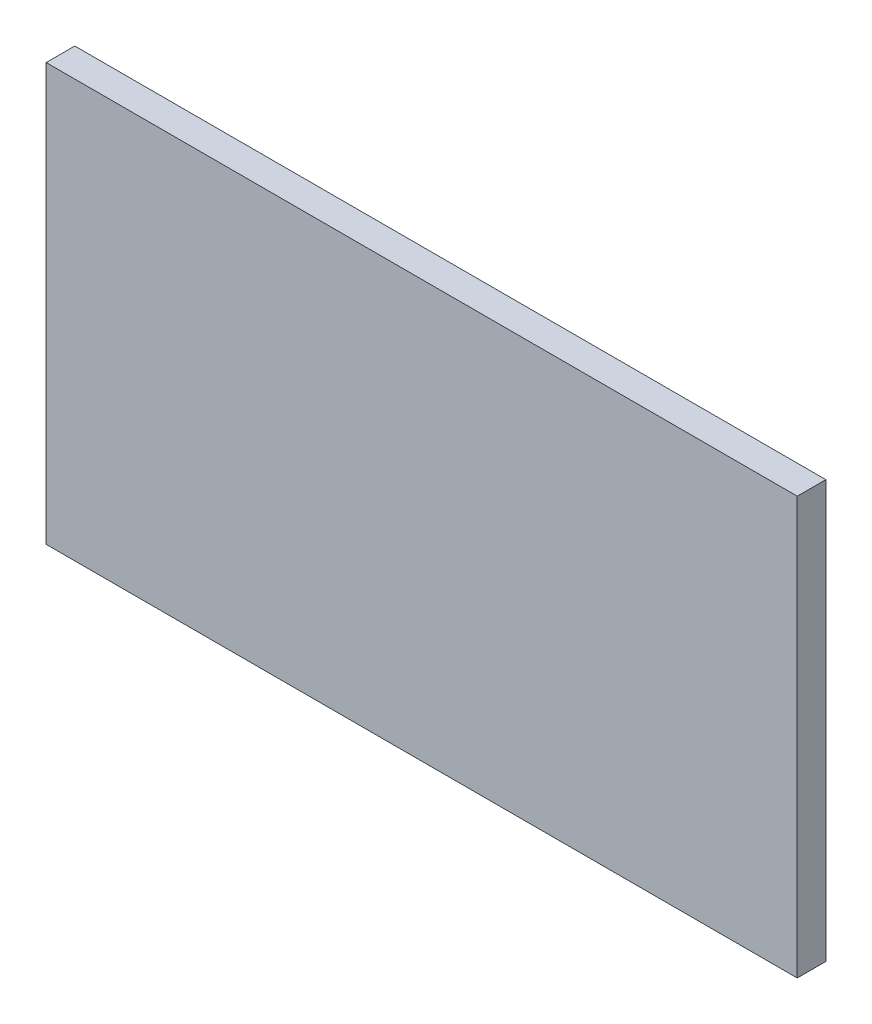
ISO-10303-21;
HEADER;
FILE_DESCRIPTION(('STEP AP214'),'2;1');
FILE_NAME('part.step','',(''),(''),'','','');
FILE_SCHEMA(('AUTOMOTIVE_DESIGN { 1 0 10303 214 1 1 1 1 }'));
ENDSEC;
DATA;
#1=APPLICATION_CONTEXT('core data for automotive mechanical design processes');
#2=APPLICATION_PROTOCOL_DEFINITION('international standard','automotive_design',2000,#1);
#3=PRODUCT_CONTEXT('',#1,'mechanical');
#4=PRODUCT('Part','Part','',(#3));
#5=PRODUCT_RELATED_PRODUCT_CATEGORY('part','',(#4));
#6=PRODUCT_DEFINITION_FORMATION('','',#4);
#7=PRODUCT_DEFINITION_CONTEXT('part definition',#1,'design');
#8=PRODUCT_DEFINITION('design','',#6,#7);
#9=PRODUCT_DEFINITION_SHAPE('','',#8);
#10=(LENGTH_UNIT() NAMED_UNIT(*) SI_UNIT(.MILLI.,.METRE.));
#11=(NAMED_UNIT(*) PLANE_ANGLE_UNIT() SI_UNIT($,.RADIAN.));
#12=(NAMED_UNIT(*) SI_UNIT($,.STERADIAN.) SOLID_ANGLE_UNIT());
#13=UNCERTAINTY_MEASURE_WITH_UNIT(LENGTH_MEASURE(1.E-05),#10,'distance_accuracy_value','');
#14=(GEOMETRIC_REPRESENTATION_CONTEXT(3) GLOBAL_UNCERTAINTY_ASSIGNED_CONTEXT((#13)) GLOBAL_UNIT_ASSIGNED_CONTEXT((#10,
#11,#12)) REPRESENTATION_CONTEXT('',''));
#15=CARTESIAN_POINT('',(0.,0.,0.));
#16=DIRECTION('',(0.,0.,1.));
#17=DIRECTION('',(1.,0.,0.));
#18=AXIS2_PLACEMENT_3D('',#15,#16,#17);
#19=CARTESIAN_POINT('',(0.70008,6.4,0.));
#20=DIRECTION('',(0.,0.,-1.));
#21=DIRECTION('',(-1.,0.,0.));
#22=AXIS2_PLACEMENT_3D('',#19,#20,#21);
#23=PLANE('',#22);
#24=DIRECTION('',(1.,0.,0.));
#25=VECTOR('',#24,1.);
#26=CARTESIAN_POINT('',(0.25008,6.65,0.));
#27=LINE('',#26,#25);
#28=CARTESIAN_POINT('',(0.25008,6.65,0.));
#29=VERTEX_POINT('',#28);
#30=CARTESIAN_POINT('',(1.15008,6.65,0.));
#31=VERTEX_POINT('',#30);
#32=EDGE_CURVE('E55',#29,#31,#27,.T.);
#33=ORIENTED_EDGE('',*,*,#32,.T.);
#34=DIRECTION('',(0.,1.,0.));
#35=VECTOR('',#34,1.);
#36=CARTESIAN_POINT('',(1.15008,6.65,0.));
#37=LINE('',#36,#35);
#38=CARTESIAN_POINT('',(1.15008,6.15,0.));
#39=VERTEX_POINT('',#38);
#40=EDGE_CURVE('E57',#31,#39,#37,.F.);
#41=ORIENTED_EDGE('',*,*,#40,.T.);
#42=DIRECTION('',(1.,0.,0.));
#43=VECTOR('',#42,1.);
#44=CARTESIAN_POINT('',(1.15008,6.15,0.));
#45=LINE('',#44,#43);
#46=CARTESIAN_POINT('',(0.25008,6.15,0.));
#47=VERTEX_POINT('',#46);
#48=EDGE_CURVE('E20',#39,#47,#45,.F.);
#49=ORIENTED_EDGE('',*,*,#48,.T.);
#50=DIRECTION('',(0.,1.,0.));
#51=VECTOR('',#50,1.);
#52=CARTESIAN_POINT('',(0.25008,6.15,0.));
#53=LINE('',#52,#51);
#54=EDGE_CURVE('E80',#47,#29,#53,.T.);
#55=ORIENTED_EDGE('',*,*,#54,.T.);
#56=EDGE_LOOP('',(#33,#41,#49,#55));
#57=FACE_BOUND('',#56,.T.);
#58=ADVANCED_FACE('F17',(#57),#23,.T.);
#59=CARTESIAN_POINT('',(1.15008,6.15,0.));
#60=DIRECTION('',(0.,1.,0.));
#61=DIRECTION('',(0.,0.,1.));
#62=AXIS2_PLACEMENT_3D('',#59,#60,#61);
#63=PLANE('',#62);
#64=DIRECTION('',(0.,0.,-1.));
#65=VECTOR('',#64,1.);
#66=CARTESIAN_POINT('',(0.25008,6.15,0.));
#67=LINE('',#66,#65);
#68=CARTESIAN_POINT('',(0.25008,6.15,0.03429));
#69=VERTEX_POINT('',#68);
#70=EDGE_CURVE('E68',#69,#47,#67,.T.);
#71=ORIENTED_EDGE('',*,*,#70,.T.);
#72=ORIENTED_EDGE('',*,*,#48,.F.);
#73=DIRECTION('',(0.,0.,1.));
#74=VECTOR('',#73,1.);
#75=CARTESIAN_POINT('',(1.15008,6.15,0.));
#76=LINE('',#75,#74);
#77=CARTESIAN_POINT('',(1.15008,6.15,0.03429));
#78=VERTEX_POINT('',#77);
#79=EDGE_CURVE('E63',#39,#78,#76,.T.);
#80=ORIENTED_EDGE('',*,*,#79,.T.);
#81=DIRECTION('',(1.,0.,0.));
#82=VECTOR('',#81,1.);
#83=CARTESIAN_POINT('',(0.70008,6.15,0.03429));
#84=LINE('',#83,#82);
#85=EDGE_CURVE('E83',#69,#78,#84,.T.);
#86=ORIENTED_EDGE('',*,*,#85,.F.);
#87=EDGE_LOOP('',(#71,#72,#80,#86));
#88=FACE_BOUND('',#87,.T.);
#89=ADVANCED_FACE('F65',(#88),#63,.F.);
#90=CARTESIAN_POINT('',(1.15008,6.65,0.));
#91=DIRECTION('',(-1.,0.,0.));
#92=DIRECTION('',(0.,0.,1.));
#93=AXIS2_PLACEMENT_3D('',#90,#91,#92);
#94=PLANE('',#93);
#95=ORIENTED_EDGE('',*,*,#79,.F.);
#96=ORIENTED_EDGE('',*,*,#40,.F.);
#97=DIRECTION('',(0.,0.,-1.));
#98=VECTOR('',#97,1.);
#99=CARTESIAN_POINT('',(1.15008,6.65,0.));
#100=LINE('',#99,#98);
#101=CARTESIAN_POINT('',(1.15008,6.65,0.03429));
#102=VERTEX_POINT('',#101);
#103=EDGE_CURVE('E75',#31,#102,#100,.F.);
#104=ORIENTED_EDGE('',*,*,#103,.T.);
#105=DIRECTION('',(0.,1.,0.));
#106=VECTOR('',#105,1.);
#107=CARTESIAN_POINT('',(1.15008,6.4,0.03429));
#108=LINE('',#107,#106);
#109=EDGE_CURVE('E72',#78,#102,#108,.T.);
#110=ORIENTED_EDGE('',*,*,#109,.F.);
#111=EDGE_LOOP('',(#95,#96,#104,#110));
#112=FACE_BOUND('',#111,.T.);
#113=ADVANCED_FACE('F70',(#112),#94,.F.);
#114=CARTESIAN_POINT('',(0.25008,6.65,0.));
#115=DIRECTION('',(0.,-1.,0.));
#116=DIRECTION('',(0.,0.,-1.));
#117=AXIS2_PLACEMENT_3D('',#114,#115,#116);
#118=PLANE('',#117);
#119=ORIENTED_EDGE('',*,*,#103,.F.);
#120=ORIENTED_EDGE('',*,*,#32,.F.);
#121=DIRECTION('',(0.,0.,-1.));
#122=VECTOR('',#121,1.);
#123=CARTESIAN_POINT('',(0.25008,6.65,0.));
#124=LINE('',#123,#122);
#125=CARTESIAN_POINT('',(0.25008,6.65,0.03429));
#126=VERTEX_POINT('',#125);
#127=EDGE_CURVE('E35',#29,#126,#124,.F.);
#128=ORIENTED_EDGE('',*,*,#127,.T.);
#129=DIRECTION('',(1.,0.,0.));
#130=VECTOR('',#129,1.);
#131=CARTESIAN_POINT('',(0.70008,6.65,0.03429));
#132=LINE('',#131,#130);
#133=EDGE_CURVE('E26',#102,#126,#132,.F.);
#134=ORIENTED_EDGE('',*,*,#133,.F.);
#135=EDGE_LOOP('',(#119,#120,#128,#134));
#136=FACE_BOUND('',#135,.T.);
#137=ADVANCED_FACE('F89',(#136),#118,.F.);
#138=CARTESIAN_POINT('',(0.25008,6.15,0.));
#139=DIRECTION('',(1.,0.,0.));
#140=DIRECTION('',(0.,0.,-1.));
#141=AXIS2_PLACEMENT_3D('',#138,#139,#140);
#142=PLANE('',#141);
#143=ORIENTED_EDGE('',*,*,#127,.F.);
#144=ORIENTED_EDGE('',*,*,#54,.F.);
#145=ORIENTED_EDGE('',*,*,#70,.F.);
#146=DIRECTION('',(0.,1.,0.));
#147=VECTOR('',#146,1.);
#148=CARTESIAN_POINT('',(0.25008,6.4,0.03429));
#149=LINE('',#148,#147);
#150=EDGE_CURVE('E11',#126,#69,#149,.F.);
#151=ORIENTED_EDGE('',*,*,#150,.F.);
#152=EDGE_LOOP('',(#143,#144,#145,#151));
#153=FACE_BOUND('',#152,.T.);
#154=ADVANCED_FACE('F91',(#153),#142,.F.);
#155=CARTESIAN_POINT('',(0.70008,6.4,0.03429));
#156=DIRECTION('',(0.,0.,1.));
#157=DIRECTION('',(1.,0.,0.));
#158=AXIS2_PLACEMENT_3D('',#155,#156,#157);
#159=PLANE('',#158);
#160=ORIENTED_EDGE('',*,*,#133,.T.);
#161=ORIENTED_EDGE('',*,*,#150,.T.);
#162=ORIENTED_EDGE('',*,*,#85,.T.);
#163=ORIENTED_EDGE('',*,*,#109,.T.);
#164=EDGE_LOOP('',(#160,#161,#162,#163));
#165=FACE_BOUND('',#164,.T.);
#166=ADVANCED_FACE('F88',(#165),#159,.T.);
#167=CLOSED_SHELL('',(#58,#89,#113,#137,#154,#166));
#168=MANIFOLD_SOLID_BREP('B1',#167);
#169=ADVANCED_BREP_SHAPE_REPRESENTATION('',(#18,#168),#14);
#170=SHAPE_DEFINITION_REPRESENTATION(#9,#169);
ENDSEC;
END-ISO-10303-21;
